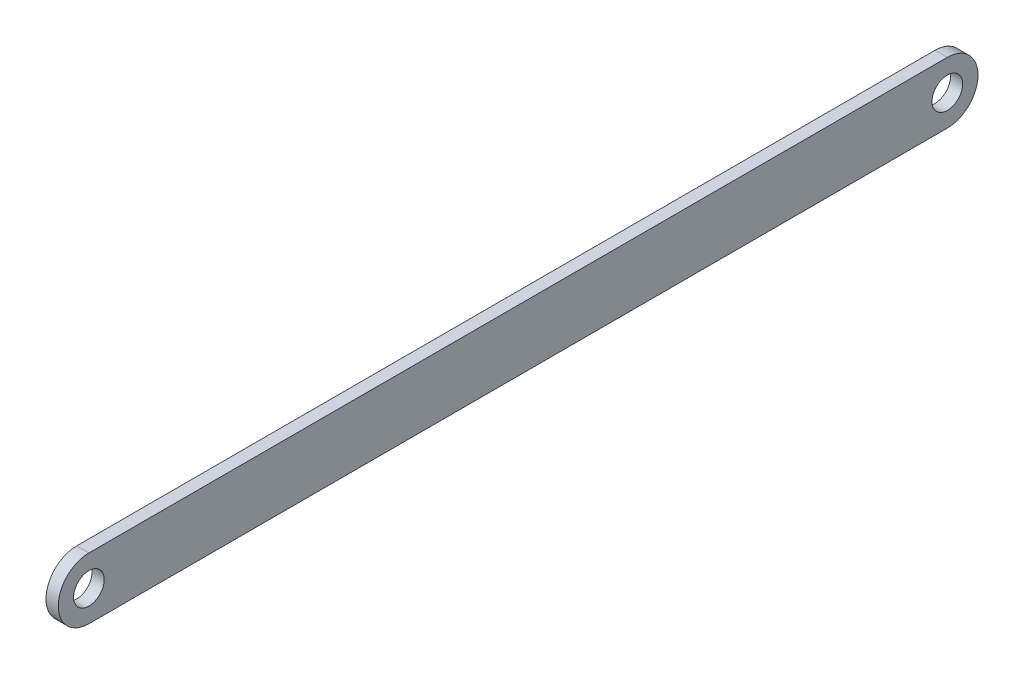
ISO-10303-21;
HEADER;
FILE_DESCRIPTION(('STEP AP214'),'2;1');
FILE_NAME('part.step','',(''),(''),'','','');
FILE_SCHEMA(('AUTOMOTIVE_DESIGN { 1 0 10303 214 1 1 1 1 }'));
ENDSEC;
DATA;
#1=APPLICATION_CONTEXT('core data for automotive mechanical design processes');
#2=APPLICATION_PROTOCOL_DEFINITION('international standard','automotive_design',2000,#1);
#3=PRODUCT_CONTEXT('',#1,'mechanical');
#4=PRODUCT('Part','Part','',(#3));
#5=PRODUCT_RELATED_PRODUCT_CATEGORY('part','',(#4));
#6=PRODUCT_DEFINITION_FORMATION('','',#4);
#7=PRODUCT_DEFINITION_CONTEXT('part definition',#1,'design');
#8=PRODUCT_DEFINITION('design','',#6,#7);
#9=PRODUCT_DEFINITION_SHAPE('','',#8);
#10=(LENGTH_UNIT() NAMED_UNIT(*) SI_UNIT(.MILLI.,.METRE.));
#11=(NAMED_UNIT(*) PLANE_ANGLE_UNIT() SI_UNIT($,.RADIAN.));
#12=(NAMED_UNIT(*) SI_UNIT($,.STERADIAN.) SOLID_ANGLE_UNIT());
#13=UNCERTAINTY_MEASURE_WITH_UNIT(LENGTH_MEASURE(1.E-05),#10,'distance_accuracy_value','');
#14=(GEOMETRIC_REPRESENTATION_CONTEXT(3) GLOBAL_UNCERTAINTY_ASSIGNED_CONTEXT((#13)) GLOBAL_UNIT_ASSIGNED_CONTEXT((#10,
#11,#12)) REPRESENTATION_CONTEXT('',''));
#15=CARTESIAN_POINT('',(0.,0.,0.));
#16=DIRECTION('',(0.,0.,1.));
#17=DIRECTION('',(1.,0.,0.));
#18=AXIS2_PLACEMENT_3D('',#15,#16,#17);
#19=CARTESIAN_POINT('',(1.,0.,70.));
#20=DIRECTION('',(1.,0.,0.));
#21=DIRECTION('',(0.,0.,-1.));
#22=AXIS2_PLACEMENT_3D('',#19,#20,#21);
#23=PLANE('',#22);
#24=CARTESIAN_POINT('',(1.,0.,-70.));
#25=DIRECTION('',(1.,0.,0.));
#26=DIRECTION('',(0.,0.,-1.));
#27=AXIS2_PLACEMENT_3D('',#24,#25,#26);
#28=CIRCLE('',#27,2.5);
#29=CARTESIAN_POINT('',(1.,0.,-72.5));
#30=VERTEX_POINT('',#29);
#31=EDGE_CURVE('E99',#30,#30,#28,.T.);
#32=ORIENTED_EDGE('',*,*,#31,.F.);
#33=EDGE_LOOP('',(#32));
#34=FACE_BOUND('',#33,.T.);
#35=CARTESIAN_POINT('',(1.,0.,70.));
#36=DIRECTION('',(1.,0.,0.));
#37=DIRECTION('',(0.,0.,-1.));
#38=AXIS2_PLACEMENT_3D('',#35,#36,#37);
#39=CIRCLE('',#38,5.);
#40=CARTESIAN_POINT('',(1.,5.,70.));
#41=VERTEX_POINT('',#40);
#42=CARTESIAN_POINT('',(1.,-5.,70.));
#43=VERTEX_POINT('',#42);
#44=EDGE_CURVE('E84',#41,#43,#39,.T.);
#45=ORIENTED_EDGE('',*,*,#44,.T.);
#46=DIRECTION('',(0.,0.,-1.));
#47=VECTOR('',#46,1.);
#48=CARTESIAN_POINT('',(1.,-5.,70.));
#49=LINE('',#48,#47);
#50=CARTESIAN_POINT('',(1.,-4.99999999999997,-70.));
#51=VERTEX_POINT('',#50);
#52=EDGE_CURVE('E79',#43,#51,#49,.T.);
#53=ORIENTED_EDGE('',*,*,#52,.T.);
#54=CARTESIAN_POINT('',(1.,0.,-70.));
#55=DIRECTION('',(1.,0.,0.));
#56=DIRECTION('',(0.,0.,-1.));
#57=AXIS2_PLACEMENT_3D('',#54,#55,#56);
#58=CIRCLE('',#57,5.);
#59=CARTESIAN_POINT('',(1.,5.00000000000002,-70.));
#60=VERTEX_POINT('',#59);
#61=EDGE_CURVE('E82',#51,#60,#58,.T.);
#62=ORIENTED_EDGE('',*,*,#61,.T.);
#63=DIRECTION('',(0.,0.,1.));
#64=VECTOR('',#63,1.);
#65=CARTESIAN_POINT('',(1.,5.,70.));
#66=LINE('',#65,#64);
#67=EDGE_CURVE('E49',#60,#41,#66,.T.);
#68=ORIENTED_EDGE('',*,*,#67,.T.);
#69=EDGE_LOOP('',(#45,#53,#62,#68));
#70=FACE_BOUND('',#69,.T.);
#71=CARTESIAN_POINT('',(1.,0.,70.));
#72=DIRECTION('',(1.,0.,0.));
#73=DIRECTION('',(0.,0.,-1.));
#74=AXIS2_PLACEMENT_3D('',#71,#72,#73);
#75=CIRCLE('',#74,2.5);
#76=CARTESIAN_POINT('',(1.,0.,67.5));
#77=VERTEX_POINT('',#76);
#78=EDGE_CURVE('E114',#77,#77,#75,.T.);
#79=ORIENTED_EDGE('',*,*,#78,.F.);
#80=EDGE_LOOP('',(#79));
#81=FACE_BOUND('',#80,.T.);
#82=ADVANCED_FACE('F32',(#34,#70,#81),#23,.T.);
#83=CARTESIAN_POINT('',(-1.,0.,70.));
#84=DIRECTION('',(1.,0.,0.));
#85=DIRECTION('',(0.,0.,-1.));
#86=AXIS2_PLACEMENT_3D('',#83,#84,#85);
#87=PLANE('',#86);
#88=CARTESIAN_POINT('',(-1.,0.,70.));
#89=DIRECTION('',(1.,0.,0.));
#90=DIRECTION('',(0.,0.,-1.));
#91=AXIS2_PLACEMENT_3D('',#88,#89,#90);
#92=CIRCLE('',#91,5.);
#93=CARTESIAN_POINT('',(-1.,5.,70.));
#94=VERTEX_POINT('',#93);
#95=CARTESIAN_POINT('',(-1.,-5.,70.));
#96=VERTEX_POINT('',#95);
#97=EDGE_CURVE('E96',#94,#96,#92,.T.);
#98=ORIENTED_EDGE('',*,*,#97,.F.);
#99=DIRECTION('',(0.,0.,1.));
#100=VECTOR('',#99,1.);
#101=CARTESIAN_POINT('',(-1.,5.,70.));
#102=LINE('',#101,#100);
#103=CARTESIAN_POINT('',(-1.,5.00000000000002,-70.));
#104=VERTEX_POINT('',#103);
#105=EDGE_CURVE('E72',#104,#94,#102,.T.);
#106=ORIENTED_EDGE('',*,*,#105,.F.);
#107=CARTESIAN_POINT('',(-1.,0.,-70.));
#108=DIRECTION('',(1.,0.,0.));
#109=DIRECTION('',(0.,0.,-1.));
#110=AXIS2_PLACEMENT_3D('',#107,#108,#109);
#111=CIRCLE('',#110,5.);
#112=CARTESIAN_POINT('',(-1.,-4.99999999999997,-70.));
#113=VERTEX_POINT('',#112);
#114=EDGE_CURVE('E66',#113,#104,#111,.T.);
#115=ORIENTED_EDGE('',*,*,#114,.F.);
#116=DIRECTION('',(0.,0.,-1.));
#117=VECTOR('',#116,1.);
#118=CARTESIAN_POINT('',(-1.,-5.,70.));
#119=LINE('',#118,#117);
#120=EDGE_CURVE('E88',#96,#113,#119,.T.);
#121=ORIENTED_EDGE('',*,*,#120,.F.);
#122=EDGE_LOOP('',(#98,#106,#115,#121));
#123=FACE_BOUND('',#122,.T.);
#124=CARTESIAN_POINT('',(-1.,0.,-70.));
#125=DIRECTION('',(1.,0.,0.));
#126=DIRECTION('',(0.,0.,-1.));
#127=AXIS2_PLACEMENT_3D('',#124,#125,#126);
#128=CIRCLE('',#127,2.5);
#129=CARTESIAN_POINT('',(-1.,0.,-72.5));
#130=VERTEX_POINT('',#129);
#131=EDGE_CURVE('E111',#130,#130,#128,.T.);
#132=ORIENTED_EDGE('',*,*,#131,.T.);
#133=EDGE_LOOP('',(#132));
#134=FACE_BOUND('',#133,.T.);
#135=CARTESIAN_POINT('',(-1.,0.,70.));
#136=DIRECTION('',(1.,0.,0.));
#137=DIRECTION('',(0.,0.,-1.));
#138=AXIS2_PLACEMENT_3D('',#135,#136,#137);
#139=CIRCLE('',#138,2.5);
#140=CARTESIAN_POINT('',(-1.,0.,67.5));
#141=VERTEX_POINT('',#140);
#142=EDGE_CURVE('E117',#141,#141,#139,.T.);
#143=ORIENTED_EDGE('',*,*,#142,.T.);
#144=EDGE_LOOP('',(#143));
#145=FACE_BOUND('',#144,.T.);
#146=ADVANCED_FACE('F107',(#123,#134,#145),#87,.F.);
#147=CARTESIAN_POINT('',(1.,0.,70.));
#148=DIRECTION('',(-1.,0.,0.));
#149=DIRECTION('',(0.,0.,1.));
#150=AXIS2_PLACEMENT_3D('',#147,#148,#149);
#151=CYLINDRICAL_SURFACE('',#150,5.);
#152=ORIENTED_EDGE('',*,*,#97,.T.);
#153=DIRECTION('',(-1.,0.,0.));
#154=VECTOR('',#153,1.);
#155=CARTESIAN_POINT('',(1.,-5.,70.));
#156=LINE('',#155,#154);
#157=EDGE_CURVE('E11',#43,#96,#156,.T.);
#158=ORIENTED_EDGE('',*,*,#157,.F.);
#159=ORIENTED_EDGE('',*,*,#44,.F.);
#160=DIRECTION('',(-1.,0.,0.));
#161=VECTOR('',#160,1.);
#162=CARTESIAN_POINT('',(1.,5.,70.));
#163=LINE('',#162,#161);
#164=EDGE_CURVE('E92',#41,#94,#163,.T.);
#165=ORIENTED_EDGE('',*,*,#164,.T.);
#166=EDGE_LOOP('',(#152,#158,#159,#165));
#167=FACE_BOUND('',#166,.T.);
#168=ADVANCED_FACE('F34',(#167),#151,.T.);
#169=CARTESIAN_POINT('',(1.,-5.,70.));
#170=DIRECTION('',(0.,1.,0.));
#171=DIRECTION('',(0.,0.,1.));
#172=AXIS2_PLACEMENT_3D('',#169,#170,#171);
#173=PLANE('',#172);
#174=ORIENTED_EDGE('',*,*,#120,.T.);
#175=DIRECTION('',(-1.,0.,0.));
#176=VECTOR('',#175,1.);
#177=CARTESIAN_POINT('',(1.,-4.99999999999997,-70.));
#178=LINE('',#177,#176);
#179=EDGE_CURVE('E41',#51,#113,#178,.T.);
#180=ORIENTED_EDGE('',*,*,#179,.F.);
#181=ORIENTED_EDGE('',*,*,#52,.F.);
#182=ORIENTED_EDGE('',*,*,#157,.T.);
#183=EDGE_LOOP('',(#174,#180,#181,#182));
#184=FACE_BOUND('',#183,.T.);
#185=ADVANCED_FACE('F87',(#184),#173,.F.);
#186=CARTESIAN_POINT('',(1.,0.,-70.));
#187=DIRECTION('',(-1.,0.,0.));
#188=DIRECTION('',(0.,0.,1.));
#189=AXIS2_PLACEMENT_3D('',#186,#187,#188);
#190=CYLINDRICAL_SURFACE('',#189,5.);
#191=ORIENTED_EDGE('',*,*,#114,.T.);
#192=DIRECTION('',(-1.,0.,0.));
#193=VECTOR('',#192,1.);
#194=CARTESIAN_POINT('',(1.,5.00000000000002,-70.));
#195=LINE('',#194,#193);
#196=EDGE_CURVE('E89',#60,#104,#195,.T.);
#197=ORIENTED_EDGE('',*,*,#196,.F.);
#198=ORIENTED_EDGE('',*,*,#61,.F.);
#199=ORIENTED_EDGE('',*,*,#179,.T.);
#200=EDGE_LOOP('',(#191,#197,#198,#199));
#201=FACE_BOUND('',#200,.T.);
#202=ADVANCED_FACE('F90',(#201),#190,.T.);
#203=CARTESIAN_POINT('',(1.,5.,70.));
#204=DIRECTION('',(0.,-1.,0.));
#205=DIRECTION('',(0.,0.,-1.));
#206=AXIS2_PLACEMENT_3D('',#203,#204,#205);
#207=PLANE('',#206);
#208=ORIENTED_EDGE('',*,*,#105,.T.);
#209=ORIENTED_EDGE('',*,*,#164,.F.);
#210=ORIENTED_EDGE('',*,*,#67,.F.);
#211=ORIENTED_EDGE('',*,*,#196,.T.);
#212=EDGE_LOOP('',(#208,#209,#210,#211));
#213=FACE_BOUND('',#212,.T.);
#214=ADVANCED_FACE('F104',(#213),#207,.F.);
#215=CARTESIAN_POINT('',(1.,0.,-70.));
#216=DIRECTION('',(-1.,0.,0.));
#217=DIRECTION('',(0.,0.,1.));
#218=AXIS2_PLACEMENT_3D('',#215,#216,#217);
#219=CYLINDRICAL_SURFACE('',#218,2.5);
#220=ORIENTED_EDGE('',*,*,#31,.T.);
#221=EDGE_LOOP('',(#220));
#222=FACE_BOUND('',#221,.T.);
#223=ORIENTED_EDGE('',*,*,#131,.F.);
#224=EDGE_LOOP('',(#223));
#225=FACE_BOUND('',#224,.T.);
#226=ADVANCED_FACE('F134',(#222,#225),#219,.F.);
#227=CARTESIAN_POINT('',(1.,0.,70.));
#228=DIRECTION('',(-1.,0.,0.));
#229=DIRECTION('',(0.,0.,1.));
#230=AXIS2_PLACEMENT_3D('',#227,#228,#229);
#231=CYLINDRICAL_SURFACE('',#230,2.5);
#232=ORIENTED_EDGE('',*,*,#78,.T.);
#233=EDGE_LOOP('',(#232));
#234=FACE_BOUND('',#233,.T.);
#235=ORIENTED_EDGE('',*,*,#142,.F.);
#236=EDGE_LOOP('',(#235));
#237=FACE_BOUND('',#236,.T.);
#238=ADVANCED_FACE('F123',(#234,#237),#231,.F.);
#239=CLOSED_SHELL('',(#82,#146,#168,#185,#202,#214,#226,#238));
#240=MANIFOLD_SOLID_BREP('B2',#239);
#241=ADVANCED_BREP_SHAPE_REPRESENTATION('',(#18,#240),#14);
#242=SHAPE_DEFINITION_REPRESENTATION(#9,#241);
ENDSEC;
END-ISO-10303-21;
